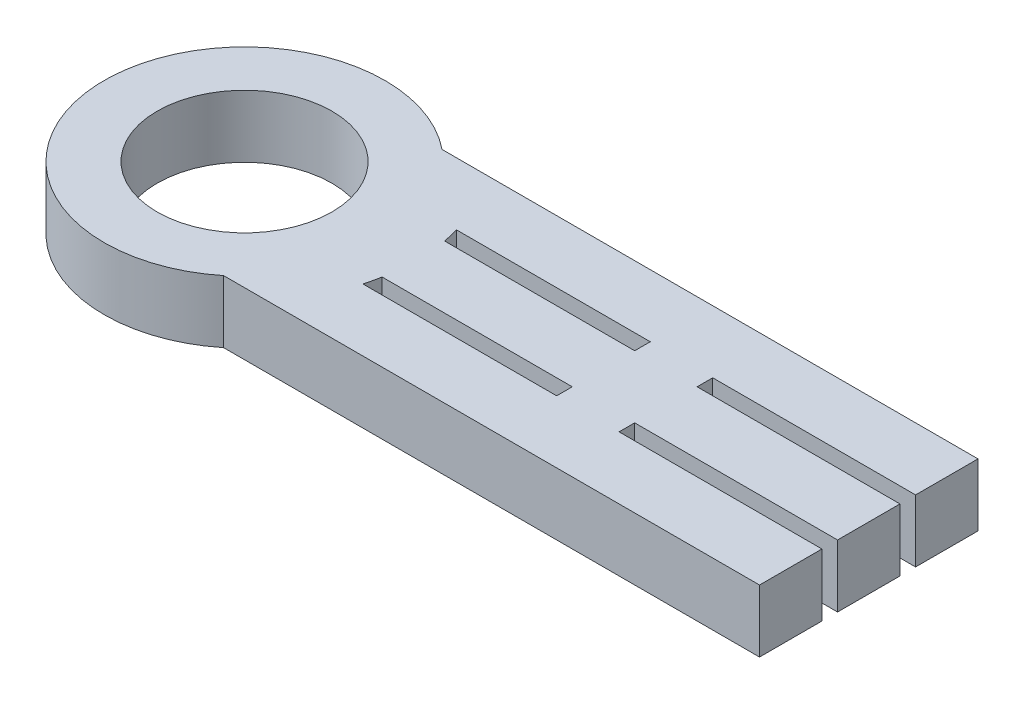
ISO-10303-21;
HEADER;
FILE_DESCRIPTION(('STEP AP214'),'2;1');
FILE_NAME('part.step','',(''),(''),'','','');
FILE_SCHEMA(('AUTOMOTIVE_DESIGN { 1 0 10303 214 1 1 1 1 }'));
ENDSEC;
DATA;
#1=APPLICATION_CONTEXT('core data for automotive mechanical design processes');
#2=APPLICATION_PROTOCOL_DEFINITION('international standard','automotive_design',2000,#1);
#3=PRODUCT_CONTEXT('',#1,'mechanical');
#4=PRODUCT('Part','Part','',(#3));
#5=PRODUCT_RELATED_PRODUCT_CATEGORY('part','',(#4));
#6=PRODUCT_DEFINITION_FORMATION('','',#4);
#7=PRODUCT_DEFINITION_CONTEXT('part definition',#1,'design');
#8=PRODUCT_DEFINITION('design','',#6,#7);
#9=PRODUCT_DEFINITION_SHAPE('','',#8);
#10=(LENGTH_UNIT() NAMED_UNIT(*) SI_UNIT(.MILLI.,.METRE.));
#11=(NAMED_UNIT(*) PLANE_ANGLE_UNIT() SI_UNIT($,.RADIAN.));
#12=(NAMED_UNIT(*) SI_UNIT($,.STERADIAN.) SOLID_ANGLE_UNIT());
#13=UNCERTAINTY_MEASURE_WITH_UNIT(LENGTH_MEASURE(1.E-05),#10,'distance_accuracy_value','');
#14=(GEOMETRIC_REPRESENTATION_CONTEXT(3) GLOBAL_UNCERTAINTY_ASSIGNED_CONTEXT((#13)) GLOBAL_UNIT_ASSIGNED_CONTEXT((#10,
#11,#12)) REPRESENTATION_CONTEXT('',''));
#15=CARTESIAN_POINT('',(0.,0.,0.));
#16=DIRECTION('',(0.,0.,1.));
#17=DIRECTION('',(1.,0.,0.));
#18=AXIS2_PLACEMENT_3D('',#15,#16,#17);
#19=CARTESIAN_POINT('',(200.,0.,0.));
#20=DIRECTION('',(-1.,0.,0.));
#21=DIRECTION('',(0.,0.,1.));
#22=AXIS2_PLACEMENT_3D('',#19,#20,#21);
#23=PLANE('',#22);
#24=DIRECTION('',(0.,-1.,0.));
#25=VECTOR('',#24,1.);
#26=CARTESIAN_POINT('',(200.,20.,10.));
#27=LINE('',#26,#25);
#28=CARTESIAN_POINT('',(200.,20.,10.));
#29=VERTEX_POINT('',#28);
#30=CARTESIAN_POINT('',(200.,0.,10.));
#31=VERTEX_POINT('',#30);
#32=EDGE_CURVE('E11',#29,#31,#27,.T.);
#33=ORIENTED_EDGE('',*,*,#32,.T.);
#34=DIRECTION('',(0.,0.,-1.));
#35=VECTOR('',#34,1.);
#36=CARTESIAN_POINT('',(200.,0.,60.));
#37=LINE('',#36,#35);
#38=CARTESIAN_POINT('',(200.,0.,-9.99999999999999));
#39=VERTEX_POINT('',#38);
#40=EDGE_CURVE('E64',#31,#39,#37,.T.);
#41=ORIENTED_EDGE('',*,*,#40,.T.);
#42=DIRECTION('',(0.,-1.,0.));
#43=VECTOR('',#42,1.);
#44=CARTESIAN_POINT('',(200.,20.,-10.));
#45=LINE('',#44,#43);
#46=CARTESIAN_POINT('',(200.,20.,-10.));
#47=VERTEX_POINT('',#46);
#48=EDGE_CURVE('E257',#47,#39,#45,.T.);
#49=ORIENTED_EDGE('',*,*,#48,.F.);
#50=DIRECTION('',(0.,0.,-1.));
#51=VECTOR('',#50,1.);
#52=CARTESIAN_POINT('',(200.,20.,60.));
#53=LINE('',#52,#51);
#54=EDGE_CURVE('E283',#29,#47,#53,.T.);
#55=ORIENTED_EDGE('',*,*,#54,.F.);
#56=EDGE_LOOP('',(#33,#41,#49,#55));
#57=FACE_BOUND('',#56,.T.);
#58=ADVANCED_FACE('F40',(#57),#23,.F.);
#59=DIRECTION('',(0.,-1.,0.));
#60=VECTOR('',#59,1.);
#61=CARTESIAN_POINT('',(200.,20.,-15.));
#62=LINE('',#61,#60);
#63=CARTESIAN_POINT('',(200.,20.,-15.));
#64=VERTEX_POINT('',#63);
#65=CARTESIAN_POINT('',(200.,0.,-15.));
#66=VERTEX_POINT('',#65);
#67=EDGE_CURVE('E232',#64,#66,#62,.T.);
#68=ORIENTED_EDGE('',*,*,#67,.T.);
#69=CARTESIAN_POINT('',(200.,0.,-35.));
#70=VERTEX_POINT('',#69);
#71=EDGE_CURVE('E260',#66,#70,#37,.T.);
#72=ORIENTED_EDGE('',*,*,#71,.T.);
#73=DIRECTION('',(0.,-1.,0.));
#74=VECTOR('',#73,1.);
#75=CARTESIAN_POINT('',(200.,20.,-35.));
#76=LINE('',#75,#74);
#77=CARTESIAN_POINT('',(200.,20.,-35.));
#78=VERTEX_POINT('',#77);
#79=EDGE_CURVE('E44',#78,#70,#76,.T.);
#80=ORIENTED_EDGE('',*,*,#79,.F.);
#81=EDGE_CURVE('E278',#64,#78,#53,.T.);
#82=ORIENTED_EDGE('',*,*,#81,.F.);
#83=EDGE_LOOP('',(#68,#72,#80,#82));
#84=FACE_BOUND('',#83,.T.);
#85=ADVANCED_FACE('F297',(#84),#23,.F.);
#86=DIRECTION('',(0.,-1.,0.));
#87=VECTOR('',#86,1.);
#88=CARTESIAN_POINT('',(200.,20.,35.));
#89=LINE('',#88,#87);
#90=CARTESIAN_POINT('',(200.,20.,35.));
#91=VERTEX_POINT('',#90);
#92=CARTESIAN_POINT('',(200.,0.,35.));
#93=VERTEX_POINT('',#92);
#94=EDGE_CURVE('E49',#91,#93,#89,.T.);
#95=ORIENTED_EDGE('',*,*,#94,.T.);
#96=CARTESIAN_POINT('',(200.,0.,15.));
#97=VERTEX_POINT('',#96);
#98=EDGE_CURVE('E57',#93,#97,#37,.T.);
#99=ORIENTED_EDGE('',*,*,#98,.T.);
#100=DIRECTION('',(0.,-1.,0.));
#101=VECTOR('',#100,1.);
#102=CARTESIAN_POINT('',(200.,20.,15.));
#103=LINE('',#102,#101);
#104=CARTESIAN_POINT('',(200.,20.,15.));
#105=VERTEX_POINT('',#104);
#106=EDGE_CURVE('E219',#105,#97,#103,.T.);
#107=ORIENTED_EDGE('',*,*,#106,.F.);
#108=EDGE_CURVE('E285',#91,#105,#53,.T.);
#109=ORIENTED_EDGE('',*,*,#108,.F.);
#110=EDGE_LOOP('',(#95,#99,#107,#109));
#111=FACE_BOUND('',#110,.T.);
#112=ADVANCED_FACE('F42',(#111),#23,.F.);
#113=CARTESIAN_POINT('',(52.9150262212918,20.,15.));
#114=DIRECTION('',(0.,0.,1.));
#115=DIRECTION('',(1.,0.,0.));
#116=AXIS2_PLACEMENT_3D('',#113,#114,#115);
#117=PLANE('',#116);
#118=DIRECTION('',(0.,1.,0.));
#119=VECTOR('',#118,1.);
#120=CARTESIAN_POINT('',(115.,0.,15.));
#121=LINE('',#120,#119);
#122=CARTESIAN_POINT('',(115.,0.,15.));
#123=VERTEX_POINT('',#122);
#124=CARTESIAN_POINT('',(115.,20.,15.));
#125=VERTEX_POINT('',#124);
#126=EDGE_CURVE('E184',#123,#125,#121,.T.);
#127=ORIENTED_EDGE('',*,*,#126,.F.);
#128=DIRECTION('',(-1.,0.,0.));
#129=VECTOR('',#128,1.);
#130=CARTESIAN_POINT('',(52.9150262212918,0.,15.));
#131=LINE('',#130,#129);
#132=CARTESIAN_POINT('',(52.9150262212918,0.,15.));
#133=VERTEX_POINT('',#132);
#134=EDGE_CURVE('E198',#123,#133,#131,.T.);
#135=ORIENTED_EDGE('',*,*,#134,.T.);
#136=DIRECTION('',(0.,-1.,0.));
#137=VECTOR('',#136,1.);
#138=CARTESIAN_POINT('',(52.9150262212918,20.,15.));
#139=LINE('',#138,#137);
#140=CARTESIAN_POINT('',(52.9150262212918,20.,15.));
#141=VERTEX_POINT('',#140);
#142=EDGE_CURVE('E223',#141,#133,#139,.T.);
#143=ORIENTED_EDGE('',*,*,#142,.F.);
#144=DIRECTION('',(-1.,0.,0.));
#145=VECTOR('',#144,1.);
#146=CARTESIAN_POINT('',(52.9150262212918,20.,15.));
#147=LINE('',#146,#145);
#148=EDGE_CURVE('E200',#125,#141,#147,.T.);
#149=ORIENTED_EDGE('',*,*,#148,.F.);
#150=EDGE_LOOP('',(#127,#135,#143,#149));
#151=FACE_BOUND('',#150,.T.);
#152=ADVANCED_FACE('F196',(#151),#117,.F.);
#153=DIRECTION('',(0.,1.,0.));
#154=VECTOR('',#153,1.);
#155=CARTESIAN_POINT('',(135.,0.,15.));
#156=LINE('',#155,#154);
#157=CARTESIAN_POINT('',(135.,0.,15.));
#158=VERTEX_POINT('',#157);
#159=CARTESIAN_POINT('',(135.,20.,15.));
#160=VERTEX_POINT('',#159);
#161=EDGE_CURVE('E201',#158,#160,#156,.T.);
#162=ORIENTED_EDGE('',*,*,#161,.T.);
#163=EDGE_CURVE('E314',#105,#160,#147,.T.);
#164=ORIENTED_EDGE('',*,*,#163,.F.);
#165=ORIENTED_EDGE('',*,*,#106,.T.);
#166=EDGE_CURVE('E206',#97,#158,#131,.T.);
#167=ORIENTED_EDGE('',*,*,#166,.T.);
#168=EDGE_LOOP('',(#162,#164,#165,#167));
#169=FACE_BOUND('',#168,.T.);
#170=ADVANCED_FACE('F315',(#169),#117,.F.);
#171=CARTESIAN_POINT('',(54.0832691319598,20.,10.));
#172=DIRECTION('',(0.,0.,-1.));
#173=DIRECTION('',(-1.,0.,0.));
#174=AXIS2_PLACEMENT_3D('',#171,#172,#173);
#175=PLANE('',#174);
#176=DIRECTION('',(0.,1.,0.));
#177=VECTOR('',#176,1.);
#178=CARTESIAN_POINT('',(115.,0.,10.));
#179=LINE('',#178,#177);
#180=CARTESIAN_POINT('',(115.,0.,10.));
#181=VERTEX_POINT('',#180);
#182=CARTESIAN_POINT('',(115.,20.,10.));
#183=VERTEX_POINT('',#182);
#184=EDGE_CURVE('E187',#181,#183,#179,.T.);
#185=ORIENTED_EDGE('',*,*,#184,.T.);
#186=DIRECTION('',(1.,0.,0.));
#187=VECTOR('',#186,1.);
#188=CARTESIAN_POINT('',(54.0832691319598,20.,10.));
#189=LINE('',#188,#187);
#190=CARTESIAN_POINT('',(54.0832691319598,20.,10.));
#191=VERTEX_POINT('',#190);
#192=EDGE_CURVE('E220',#191,#183,#189,.T.);
#193=ORIENTED_EDGE('',*,*,#192,.F.);
#194=DIRECTION('',(0.,-1.,0.));
#195=VECTOR('',#194,1.);
#196=CARTESIAN_POINT('',(54.0832691319598,20.,10.));
#197=LINE('',#196,#195);
#198=CARTESIAN_POINT('',(54.0832691319598,0.,10.));
#199=VERTEX_POINT('',#198);
#200=EDGE_CURVE('E217',#191,#199,#197,.T.);
#201=ORIENTED_EDGE('',*,*,#200,.T.);
#202=DIRECTION('',(1.,0.,0.));
#203=VECTOR('',#202,1.);
#204=CARTESIAN_POINT('',(54.0832691319598,0.,10.));
#205=LINE('',#204,#203);
#206=EDGE_CURVE('E214',#199,#181,#205,.T.);
#207=ORIENTED_EDGE('',*,*,#206,.T.);
#208=EDGE_LOOP('',(#185,#193,#201,#207));
#209=FACE_BOUND('',#208,.T.);
#210=ADVANCED_FACE('F329',(#209),#175,.F.);
#211=DIRECTION('',(0.,1.,0.));
#212=VECTOR('',#211,1.);
#213=CARTESIAN_POINT('',(135.,0.,10.));
#214=LINE('',#213,#212);
#215=CARTESIAN_POINT('',(135.,0.,10.));
#216=VERTEX_POINT('',#215);
#217=CARTESIAN_POINT('',(135.,20.,10.));
#218=VERTEX_POINT('',#217);
#219=EDGE_CURVE('E331',#216,#218,#214,.T.);
#220=ORIENTED_EDGE('',*,*,#219,.F.);
#221=EDGE_CURVE('E209',#216,#31,#205,.T.);
#222=ORIENTED_EDGE('',*,*,#221,.T.);
#223=ORIENTED_EDGE('',*,*,#32,.F.);
#224=EDGE_CURVE('E317',#218,#29,#189,.T.);
#225=ORIENTED_EDGE('',*,*,#224,.F.);
#226=EDGE_LOOP('',(#220,#222,#223,#225));
#227=FACE_BOUND('',#226,.T.);
#228=ADVANCED_FACE('F422',(#227),#175,.F.);
#229=CARTESIAN_POINT('',(54.0832691319598,20.,-10.));
#230=DIRECTION('',(0.,0.,-1.));
#231=DIRECTION('',(-1.,0.,0.));
#232=AXIS2_PLACEMENT_3D('',#229,#230,#231);
#233=PLANE('',#232);
#234=DIRECTION('',(0.,1.,0.));
#235=VECTOR('',#234,1.);
#236=CARTESIAN_POINT('',(115.,0.,-10.));
#237=LINE('',#236,#235);
#238=CARTESIAN_POINT('',(115.,0.,-10.));
#239=VERTEX_POINT('',#238);
#240=CARTESIAN_POINT('',(115.,20.,-10.));
#241=VERTEX_POINT('',#240);
#242=EDGE_CURVE('E347',#239,#241,#237,.T.);
#243=ORIENTED_EDGE('',*,*,#242,.F.);
#244=DIRECTION('',(1.,0.,0.));
#245=VECTOR('',#244,1.);
#246=CARTESIAN_POINT('',(54.0832691319598,0.,-10.));
#247=LINE('',#246,#245);
#248=CARTESIAN_POINT('',(54.0832691319598,0.,-10.));
#249=VERTEX_POINT('',#248);
#250=EDGE_CURVE('E249',#249,#239,#247,.T.);
#251=ORIENTED_EDGE('',*,*,#250,.F.);
#252=DIRECTION('',(0.,-1.,0.));
#253=VECTOR('',#252,1.);
#254=CARTESIAN_POINT('',(54.0832691319598,20.,-10.));
#255=LINE('',#254,#253);
#256=CARTESIAN_POINT('',(54.0832691319598,20.,-10.));
#257=VERTEX_POINT('',#256);
#258=EDGE_CURVE('E262',#257,#249,#255,.T.);
#259=ORIENTED_EDGE('',*,*,#258,.F.);
#260=DIRECTION('',(1.,0.,0.));
#261=VECTOR('',#260,1.);
#262=CARTESIAN_POINT('',(54.0832691319598,20.,-10.));
#263=LINE('',#262,#261);
#264=EDGE_CURVE('E240',#257,#241,#263,.T.);
#265=ORIENTED_EDGE('',*,*,#264,.T.);
#266=EDGE_LOOP('',(#243,#251,#259,#265));
#267=FACE_BOUND('',#266,.T.);
#268=ADVANCED_FACE('F376',(#267),#233,.T.);
#269=CARTESIAN_POINT('',(52.9150262212918,20.,-15.));
#270=DIRECTION('',(0.,0.,1.));
#271=DIRECTION('',(1.,0.,0.));
#272=AXIS2_PLACEMENT_3D('',#269,#270,#271);
#273=PLANE('',#272);
#274=DIRECTION('',(0.,1.,0.));
#275=VECTOR('',#274,1.);
#276=CARTESIAN_POINT('',(115.,0.,-15.));
#277=LINE('',#276,#275);
#278=CARTESIAN_POINT('',(115.,0.,-15.));
#279=VERTEX_POINT('',#278);
#280=CARTESIAN_POINT('',(115.,20.,-15.));
#281=VERTEX_POINT('',#280);
#282=EDGE_CURVE('E351',#279,#281,#277,.T.);
#283=ORIENTED_EDGE('',*,*,#282,.T.);
#284=DIRECTION('',(-1.,0.,0.));
#285=VECTOR('',#284,1.);
#286=CARTESIAN_POINT('',(52.9150262212918,20.,-15.));
#287=LINE('',#286,#285);
#288=CARTESIAN_POINT('',(52.9150262212918,20.,-15.));
#289=VERTEX_POINT('',#288);
#290=EDGE_CURVE('E242',#281,#289,#287,.T.);
#291=ORIENTED_EDGE('',*,*,#290,.T.);
#292=DIRECTION('',(0.,-1.,0.));
#293=VECTOR('',#292,1.);
#294=CARTESIAN_POINT('',(52.9150262212918,20.,-15.));
#295=LINE('',#294,#293);
#296=CARTESIAN_POINT('',(52.9150262212918,0.,-15.));
#297=VERTEX_POINT('',#296);
#298=EDGE_CURVE('E245',#289,#297,#295,.T.);
#299=ORIENTED_EDGE('',*,*,#298,.T.);
#300=DIRECTION('',(-1.,0.,0.));
#301=VECTOR('',#300,1.);
#302=CARTESIAN_POINT('',(52.9150262212918,0.,-15.));
#303=LINE('',#302,#301);
#304=EDGE_CURVE('E252',#279,#297,#303,.T.);
#305=ORIENTED_EDGE('',*,*,#304,.F.);
#306=EDGE_LOOP('',(#283,#291,#299,#305));
#307=FACE_BOUND('',#306,.T.);
#308=ADVANCED_FACE('F372',(#307),#273,.T.);
#309=CARTESIAN_POINT('',(0.,20.,0.));
#310=DIRECTION('',(0.,1.,0.));
#311=DIRECTION('',(0.,0.,1.));
#312=AXIS2_PLACEMENT_3D('',#309,#310,#311);
#313=PLANE('',#312);
#314=DIRECTION('',(0.,0.,-1.));
#315=VECTOR('',#314,1.);
#316=CARTESIAN_POINT('',(115.,20.,15.));
#317=LINE('',#316,#315);
#318=EDGE_CURVE('E326',#125,#183,#317,.T.);
#319=ORIENTED_EDGE('',*,*,#318,.F.);
#320=ORIENTED_EDGE('',*,*,#148,.T.);
#321=CARTESIAN_POINT('',(0.,20.,0.));
#322=DIRECTION('',(0.,1.,0.));
#323=DIRECTION('',(0.,0.,1.));
#324=AXIS2_PLACEMENT_3D('',#321,#322,#323);
#325=CIRCLE('',#324,55.);
#326=EDGE_CURVE('E216',#141,#191,#325,.T.);
#327=ORIENTED_EDGE('',*,*,#326,.T.);
#328=ORIENTED_EDGE('',*,*,#192,.T.);
#329=EDGE_LOOP('',(#319,#320,#327,#328));
#330=FACE_BOUND('',#329,.T.);
#331=CARTESIAN_POINT('',(135.,20.,-10.));
#332=VERTEX_POINT('',#331);
#333=EDGE_CURVE('E238',#332,#47,#263,.T.);
#334=ORIENTED_EDGE('',*,*,#333,.F.);
#335=DIRECTION('',(0.,0.,-1.));
#336=VECTOR('',#335,1.);
#337=CARTESIAN_POINT('',(135.,20.,-15.));
#338=LINE('',#337,#336);
#339=CARTESIAN_POINT('',(135.,20.,-15.));
#340=VERTEX_POINT('',#339);
#341=EDGE_CURVE('E334',#332,#340,#338,.T.);
#342=ORIENTED_EDGE('',*,*,#341,.T.);
#343=EDGE_CURVE('E243',#64,#340,#287,.T.);
#344=ORIENTED_EDGE('',*,*,#343,.F.);
#345=ORIENTED_EDGE('',*,*,#81,.T.);
#346=DIRECTION('',(-1.,0.,0.));
#347=VECTOR('',#346,1.);
#348=CARTESIAN_POINT('',(28.2842712474619,20.,-35.));
#349=LINE('',#348,#347);
#350=CARTESIAN_POINT('',(28.2842712474619,20.,-35.));
#351=VERTEX_POINT('',#350);
#352=EDGE_CURVE('E268',#78,#351,#349,.T.);
#353=ORIENTED_EDGE('',*,*,#352,.T.);
#354=CARTESIAN_POINT('',(0.,20.,0.));
#355=DIRECTION('',(0.,1.,0.));
#356=DIRECTION('',(0.,0.,1.));
#357=AXIS2_PLACEMENT_3D('',#354,#355,#356);
#358=CIRCLE('',#357,45.);
#359=CARTESIAN_POINT('',(28.2842712474619,20.,35.));
#360=VERTEX_POINT('',#359);
#361=EDGE_CURVE('E266',#351,#360,#358,.T.);
#362=ORIENTED_EDGE('',*,*,#361,.T.);
#363=DIRECTION('',(-1.,0.,0.));
#364=VECTOR('',#363,1.);
#365=CARTESIAN_POINT('',(28.2842712474619,20.,35.));
#366=LINE('',#365,#364);
#367=EDGE_CURVE('E226',#91,#360,#366,.T.);
#368=ORIENTED_EDGE('',*,*,#367,.F.);
#369=ORIENTED_EDGE('',*,*,#108,.T.);
#370=ORIENTED_EDGE('',*,*,#163,.T.);
#371=DIRECTION('',(0.,0.,1.));
#372=VECTOR('',#371,1.);
#373=CARTESIAN_POINT('',(135.,20.,15.));
#374=LINE('',#373,#372);
#375=EDGE_CURVE('E193',#218,#160,#374,.T.);
#376=ORIENTED_EDGE('',*,*,#375,.F.);
#377=ORIENTED_EDGE('',*,*,#224,.T.);
#378=ORIENTED_EDGE('',*,*,#54,.T.);
#379=EDGE_LOOP('',(#334,#342,#344,#345,#353,#362,#368,#369,#370,#376,#377,#378));
#380=FACE_BOUND('',#379,.T.);
#381=CARTESIAN_POINT('',(0.,20.,0.));
#382=DIRECTION('',(0.,1.,0.));
#383=DIRECTION('',(0.,0.,1.));
#384=AXIS2_PLACEMENT_3D('',#381,#382,#383);
#385=CIRCLE('',#384,28.);
#386=CARTESIAN_POINT('',(0.,20.,28.));
#387=VERTEX_POINT('',#386);
#388=EDGE_CURVE('E354',#387,#387,#385,.T.);
#389=ORIENTED_EDGE('',*,*,#388,.F.);
#390=EDGE_LOOP('',(#389));
#391=FACE_BOUND('',#390,.T.);
#392=DIRECTION('',(0.,0.,1.));
#393=VECTOR('',#392,1.);
#394=CARTESIAN_POINT('',(115.,20.,-15.));
#395=LINE('',#394,#393);
#396=EDGE_CURVE('E330',#281,#241,#395,.T.);
#397=ORIENTED_EDGE('',*,*,#396,.T.);
#398=ORIENTED_EDGE('',*,*,#264,.F.);
#399=CARTESIAN_POINT('',(0.,20.,0.));
#400=DIRECTION('',(0.,-1.,0.));
#401=DIRECTION('',(0.,0.,-1.));
#402=AXIS2_PLACEMENT_3D('',#399,#400,#401);
#403=CIRCLE('',#402,55.);
#404=EDGE_CURVE('E236',#289,#257,#403,.T.);
#405=ORIENTED_EDGE('',*,*,#404,.F.);
#406=ORIENTED_EDGE('',*,*,#290,.F.);
#407=EDGE_LOOP('',(#397,#398,#405,#406));
#408=FACE_BOUND('',#407,.T.);
#409=ADVANCED_FACE('F305',(#330,#380,#391,#408),#313,.T.);
#410=CARTESIAN_POINT('',(0.,0.,0.));
#411=DIRECTION('',(0.,1.,0.));
#412=DIRECTION('',(0.,0.,1.));
#413=AXIS2_PLACEMENT_3D('',#410,#411,#412);
#414=PLANE('',#413);
#415=ORIENTED_EDGE('',*,*,#134,.F.);
#416=DIRECTION('',(0.,0.,-1.));
#417=VECTOR('',#416,1.);
#418=CARTESIAN_POINT('',(115.,0.,15.));
#419=LINE('',#418,#417);
#420=EDGE_CURVE('E181',#123,#181,#419,.T.);
#421=ORIENTED_EDGE('',*,*,#420,.T.);
#422=ORIENTED_EDGE('',*,*,#206,.F.);
#423=CARTESIAN_POINT('',(0.,0.,0.));
#424=DIRECTION('',(0.,1.,0.));
#425=DIRECTION('',(0.,0.,1.));
#426=AXIS2_PLACEMENT_3D('',#423,#424,#425);
#427=CIRCLE('',#426,55.);
#428=EDGE_CURVE('E205',#133,#199,#427,.T.);
#429=ORIENTED_EDGE('',*,*,#428,.F.);
#430=EDGE_LOOP('',(#415,#421,#422,#429));
#431=FACE_BOUND('',#430,.T.);
#432=DIRECTION('',(0.,0.,-1.));
#433=VECTOR('',#432,1.);
#434=CARTESIAN_POINT('',(135.,0.,-15.));
#435=LINE('',#434,#433);
#436=CARTESIAN_POINT('',(135.,0.,-10.));
#437=VERTEX_POINT('',#436);
#438=CARTESIAN_POINT('',(135.,0.,-15.));
#439=VERTEX_POINT('',#438);
#440=EDGE_CURVE('E345',#437,#439,#435,.T.);
#441=ORIENTED_EDGE('',*,*,#440,.F.);
#442=EDGE_CURVE('E248',#437,#39,#247,.T.);
#443=ORIENTED_EDGE('',*,*,#442,.T.);
#444=ORIENTED_EDGE('',*,*,#40,.F.);
#445=ORIENTED_EDGE('',*,*,#221,.F.);
#446=DIRECTION('',(0.,0.,1.));
#447=VECTOR('',#446,1.);
#448=CARTESIAN_POINT('',(135.,0.,15.));
#449=LINE('',#448,#447);
#450=EDGE_CURVE('E192',#216,#158,#449,.T.);
#451=ORIENTED_EDGE('',*,*,#450,.T.);
#452=ORIENTED_EDGE('',*,*,#166,.F.);
#453=ORIENTED_EDGE('',*,*,#98,.F.);
#454=DIRECTION('',(-1.,0.,0.));
#455=VECTOR('',#454,1.);
#456=CARTESIAN_POINT('',(28.2842712474619,0.,35.));
#457=LINE('',#456,#455);
#458=CARTESIAN_POINT('',(28.2842712474619,0.,35.));
#459=VERTEX_POINT('',#458);
#460=EDGE_CURVE('E225',#93,#459,#457,.T.);
#461=ORIENTED_EDGE('',*,*,#460,.T.);
#462=CARTESIAN_POINT('',(0.,0.,0.));
#463=DIRECTION('',(0.,1.,0.));
#464=DIRECTION('',(0.,0.,1.));
#465=AXIS2_PLACEMENT_3D('',#462,#463,#464);
#466=CIRCLE('',#465,45.);
#467=CARTESIAN_POINT('',(28.2842712474619,0.,-35.));
#468=VERTEX_POINT('',#467);
#469=EDGE_CURVE('E265',#468,#459,#466,.T.);
#470=ORIENTED_EDGE('',*,*,#469,.F.);
#471=DIRECTION('',(-1.,0.,0.));
#472=VECTOR('',#471,1.);
#473=CARTESIAN_POINT('',(28.2842712474619,0.,-35.));
#474=LINE('',#473,#472);
#475=EDGE_CURVE('E269',#70,#468,#474,.T.);
#476=ORIENTED_EDGE('',*,*,#475,.F.);
#477=ORIENTED_EDGE('',*,*,#71,.F.);
#478=EDGE_CURVE('E239',#66,#439,#303,.T.);
#479=ORIENTED_EDGE('',*,*,#478,.T.);
#480=EDGE_LOOP('',(#441,#443,#444,#445,#451,#452,#453,#461,#470,#476,#477,#479));
#481=FACE_BOUND('',#480,.T.);
#482=CARTESIAN_POINT('',(0.,0.,0.));
#483=DIRECTION('',(0.,1.,0.));
#484=DIRECTION('',(0.,0.,1.));
#485=AXIS2_PLACEMENT_3D('',#482,#483,#484);
#486=CIRCLE('',#485,28.);
#487=CARTESIAN_POINT('',(0.,0.,28.));
#488=VERTEX_POINT('',#487);
#489=EDGE_CURVE('E210',#488,#488,#486,.T.);
#490=ORIENTED_EDGE('',*,*,#489,.T.);
#491=EDGE_LOOP('',(#490));
#492=FACE_BOUND('',#491,.T.);
#493=ORIENTED_EDGE('',*,*,#250,.T.);
#494=DIRECTION('',(0.,0.,1.));
#495=VECTOR('',#494,1.);
#496=CARTESIAN_POINT('',(115.,0.,-15.));
#497=LINE('',#496,#495);
#498=EDGE_CURVE('E342',#279,#239,#497,.T.);
#499=ORIENTED_EDGE('',*,*,#498,.F.);
#500=ORIENTED_EDGE('',*,*,#304,.T.);
#501=CARTESIAN_POINT('',(0.,0.,0.));
#502=DIRECTION('',(0.,-1.,0.));
#503=DIRECTION('',(0.,0.,-1.));
#504=AXIS2_PLACEMENT_3D('',#501,#502,#503);
#505=CIRCLE('',#504,55.);
#506=EDGE_CURVE('E235',#297,#249,#505,.T.);
#507=ORIENTED_EDGE('',*,*,#506,.T.);
#508=EDGE_LOOP('',(#493,#499,#500,#507));
#509=FACE_BOUND('',#508,.T.);
#510=ADVANCED_FACE('F204',(#431,#481,#492,#509),#414,.F.);
#511=CARTESIAN_POINT('',(0.,20.,0.));
#512=DIRECTION('',(0.,-1.,0.));
#513=DIRECTION('',(0.,0.,-1.));
#514=AXIS2_PLACEMENT_3D('',#511,#512,#513);
#515=CYLINDRICAL_SURFACE('',#514,45.);
#516=ORIENTED_EDGE('',*,*,#469,.T.);
#517=DIRECTION('',(0.,-1.,0.));
#518=VECTOR('',#517,1.);
#519=CARTESIAN_POINT('',(28.2842712474619,20.,35.));
#520=LINE('',#519,#518);
#521=EDGE_CURVE('E229',#360,#459,#520,.T.);
#522=ORIENTED_EDGE('',*,*,#521,.F.);
#523=ORIENTED_EDGE('',*,*,#361,.F.);
#524=DIRECTION('',(0.,-1.,0.));
#525=VECTOR('',#524,1.);
#526=CARTESIAN_POINT('',(28.2842712474619,20.,-35.));
#527=LINE('',#526,#525);
#528=EDGE_CURVE('E271',#351,#468,#527,.T.);
#529=ORIENTED_EDGE('',*,*,#528,.T.);
#530=EDGE_LOOP('',(#516,#522,#523,#529));
#531=FACE_BOUND('',#530,.T.);
#532=ADVANCED_FACE('F304',(#531),#515,.T.);
#533=CARTESIAN_POINT('',(28.2842712474619,20.,-35.));
#534=DIRECTION('',(0.,0.,1.));
#535=DIRECTION('',(1.,0.,0.));
#536=AXIS2_PLACEMENT_3D('',#533,#534,#535);
#537=PLANE('',#536);
#538=ORIENTED_EDGE('',*,*,#475,.T.);
#539=ORIENTED_EDGE('',*,*,#528,.F.);
#540=ORIENTED_EDGE('',*,*,#352,.F.);
#541=ORIENTED_EDGE('',*,*,#79,.T.);
#542=EDGE_LOOP('',(#538,#539,#540,#541));
#543=FACE_BOUND('',#542,.T.);
#544=ADVANCED_FACE('F302',(#543),#537,.F.);
#545=CARTESIAN_POINT('',(0.,20.,0.));
#546=DIRECTION('',(0.,-1.,0.));
#547=DIRECTION('',(0.,0.,-1.));
#548=AXIS2_PLACEMENT_3D('',#545,#546,#547);
#549=CYLINDRICAL_SURFACE('',#548,55.);
#550=ORIENTED_EDGE('',*,*,#506,.F.);
#551=ORIENTED_EDGE('',*,*,#298,.F.);
#552=ORIENTED_EDGE('',*,*,#404,.T.);
#553=ORIENTED_EDGE('',*,*,#258,.T.);
#554=EDGE_LOOP('',(#550,#551,#552,#553));
#555=FACE_BOUND('',#554,.T.);
#556=ADVANCED_FACE('F378',(#555),#549,.T.);
#557=DIRECTION('',(0.,1.,0.));
#558=VECTOR('',#557,1.);
#559=CARTESIAN_POINT('',(135.,0.,-10.));
#560=LINE('',#559,#558);
#561=EDGE_CURVE('E358',#437,#332,#560,.T.);
#562=ORIENTED_EDGE('',*,*,#561,.T.);
#563=ORIENTED_EDGE('',*,*,#333,.T.);
#564=ORIENTED_EDGE('',*,*,#48,.T.);
#565=ORIENTED_EDGE('',*,*,#442,.F.);
#566=EDGE_LOOP('',(#562,#563,#564,#565));
#567=FACE_BOUND('',#566,.T.);
#568=ADVANCED_FACE('F380',(#567),#233,.T.);
#569=DIRECTION('',(0.,1.,0.));
#570=VECTOR('',#569,1.);
#571=CARTESIAN_POINT('',(135.,0.,-15.));
#572=LINE('',#571,#570);
#573=EDGE_CURVE('E355',#439,#340,#572,.T.);
#574=ORIENTED_EDGE('',*,*,#573,.F.);
#575=ORIENTED_EDGE('',*,*,#478,.F.);
#576=ORIENTED_EDGE('',*,*,#67,.F.);
#577=ORIENTED_EDGE('',*,*,#343,.T.);
#578=EDGE_LOOP('',(#574,#575,#576,#577));
#579=FACE_BOUND('',#578,.T.);
#580=ADVANCED_FACE('F386',(#579),#273,.T.);
#581=CARTESIAN_POINT('',(28.2842712474619,20.,35.));
#582=DIRECTION('',(0.,0.,1.));
#583=DIRECTION('',(1.,0.,0.));
#584=AXIS2_PLACEMENT_3D('',#581,#582,#583);
#585=PLANE('',#584);
#586=ORIENTED_EDGE('',*,*,#460,.F.);
#587=ORIENTED_EDGE('',*,*,#94,.F.);
#588=ORIENTED_EDGE('',*,*,#367,.T.);
#589=ORIENTED_EDGE('',*,*,#521,.T.);
#590=EDGE_LOOP('',(#586,#587,#588,#589));
#591=FACE_BOUND('',#590,.T.);
#592=ADVANCED_FACE('F310',(#591),#585,.T.);
#593=CARTESIAN_POINT('',(0.,20.,0.));
#594=DIRECTION('',(0.,-1.,0.));
#595=DIRECTION('',(0.,0.,-1.));
#596=AXIS2_PLACEMENT_3D('',#593,#594,#595);
#597=CYLINDRICAL_SURFACE('',#596,55.);
#598=ORIENTED_EDGE('',*,*,#428,.T.);
#599=ORIENTED_EDGE('',*,*,#200,.F.);
#600=ORIENTED_EDGE('',*,*,#326,.F.);
#601=ORIENTED_EDGE('',*,*,#142,.T.);
#602=EDGE_LOOP('',(#598,#599,#600,#601));
#603=FACE_BOUND('',#602,.T.);
#604=ADVANCED_FACE('F419',(#603),#597,.T.);
#605=CARTESIAN_POINT('',(0.,0.,0.));
#606=DIRECTION('',(0.,1.,0.));
#607=DIRECTION('',(0.,0.,1.));
#608=AXIS2_PLACEMENT_3D('',#605,#606,#607);
#609=CYLINDRICAL_SURFACE('',#608,28.);
#610=ORIENTED_EDGE('',*,*,#489,.F.);
#611=EDGE_LOOP('',(#610));
#612=FACE_BOUND('',#611,.T.);
#613=ORIENTED_EDGE('',*,*,#388,.T.);
#614=EDGE_LOOP('',(#613));
#615=FACE_BOUND('',#614,.T.);
#616=ADVANCED_FACE('F416',(#612,#615),#609,.F.);
#617=CARTESIAN_POINT('',(115.,0.,-15.));
#618=DIRECTION('',(-1.,0.,0.));
#619=DIRECTION('',(0.,0.,1.));
#620=AXIS2_PLACEMENT_3D('',#617,#618,#619);
#621=PLANE('',#620);
#622=ORIENTED_EDGE('',*,*,#396,.F.);
#623=ORIENTED_EDGE('',*,*,#282,.F.);
#624=ORIENTED_EDGE('',*,*,#498,.T.);
#625=ORIENTED_EDGE('',*,*,#242,.T.);
#626=EDGE_LOOP('',(#622,#623,#624,#625));
#627=FACE_BOUND('',#626,.T.);
#628=ADVANCED_FACE('F363',(#627),#621,.T.);
#629=CARTESIAN_POINT('',(135.,0.,-15.));
#630=DIRECTION('',(1.,0.,0.));
#631=DIRECTION('',(0.,0.,-1.));
#632=AXIS2_PLACEMENT_3D('',#629,#630,#631);
#633=PLANE('',#632);
#634=ORIENTED_EDGE('',*,*,#341,.F.);
#635=ORIENTED_EDGE('',*,*,#561,.F.);
#636=ORIENTED_EDGE('',*,*,#440,.T.);
#637=ORIENTED_EDGE('',*,*,#573,.T.);
#638=EDGE_LOOP('',(#634,#635,#636,#637));
#639=FACE_BOUND('',#638,.T.);
#640=ADVANCED_FACE('F408',(#639),#633,.T.);
#641=CARTESIAN_POINT('',(115.,0.,15.));
#642=DIRECTION('',(1.,0.,0.));
#643=DIRECTION('',(0.,0.,-1.));
#644=AXIS2_PLACEMENT_3D('',#641,#642,#643);
#645=PLANE('',#644);
#646=ORIENTED_EDGE('',*,*,#318,.T.);
#647=ORIENTED_EDGE('',*,*,#184,.F.);
#648=ORIENTED_EDGE('',*,*,#420,.F.);
#649=ORIENTED_EDGE('',*,*,#126,.T.);
#650=EDGE_LOOP('',(#646,#647,#648,#649));
#651=FACE_BOUND('',#650,.T.);
#652=ADVANCED_FACE('F183',(#651),#645,.F.);
#653=CARTESIAN_POINT('',(135.,0.,15.));
#654=DIRECTION('',(-1.,0.,0.));
#655=DIRECTION('',(0.,0.,1.));
#656=AXIS2_PLACEMENT_3D('',#653,#654,#655);
#657=PLANE('',#656);
#658=ORIENTED_EDGE('',*,*,#375,.T.);
#659=ORIENTED_EDGE('',*,*,#161,.F.);
#660=ORIENTED_EDGE('',*,*,#450,.F.);
#661=ORIENTED_EDGE('',*,*,#219,.T.);
#662=EDGE_LOOP('',(#658,#659,#660,#661));
#663=FACE_BOUND('',#662,.T.);
#664=ADVANCED_FACE('F397',(#663),#657,.F.);
#665=CLOSED_SHELL('',(#58,#85,#112,#152,#170,#210,#228,#268,#308,#409,#510,#532,#544,#556,#568,
#580,#592,#604,#616,#628,#640,#652,#664));
#666=MANIFOLD_SOLID_BREP('B2',#665);
#667=ADVANCED_BREP_SHAPE_REPRESENTATION('',(#18,#666),#14);
#668=SHAPE_DEFINITION_REPRESENTATION(#9,#667);
ENDSEC;
END-ISO-10303-21;
